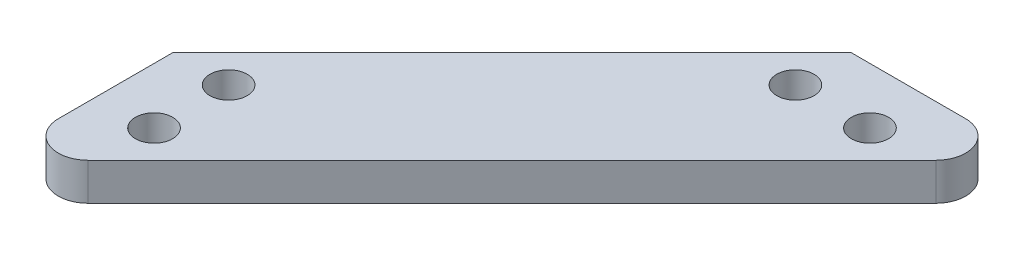
ISO-10303-21;
HEADER;
FILE_DESCRIPTION(('STEP AP214'),'2;1');
FILE_NAME('part.step','',(''),(''),'','','');
FILE_SCHEMA(('AUTOMOTIVE_DESIGN { 1 0 10303 214 1 1 1 1 }'));
ENDSEC;
DATA;
#1=APPLICATION_CONTEXT('core data for automotive mechanical design processes');
#2=APPLICATION_PROTOCOL_DEFINITION('international standard','automotive_design',2000,#1);
#3=PRODUCT_CONTEXT('',#1,'mechanical');
#4=PRODUCT('Part','Part','',(#3));
#5=PRODUCT_RELATED_PRODUCT_CATEGORY('part','',(#4));
#6=PRODUCT_DEFINITION_FORMATION('','',#4);
#7=PRODUCT_DEFINITION_CONTEXT('part definition',#1,'design');
#8=PRODUCT_DEFINITION('design','',#6,#7);
#9=PRODUCT_DEFINITION_SHAPE('','',#8);
#10=(LENGTH_UNIT() NAMED_UNIT(*) SI_UNIT(.MILLI.,.METRE.));
#11=(NAMED_UNIT(*) PLANE_ANGLE_UNIT() SI_UNIT($,.RADIAN.));
#12=(NAMED_UNIT(*) SI_UNIT($,.STERADIAN.) SOLID_ANGLE_UNIT());
#13=UNCERTAINTY_MEASURE_WITH_UNIT(LENGTH_MEASURE(1.E-05),#10,'distance_accuracy_value','');
#14=(GEOMETRIC_REPRESENTATION_CONTEXT(3) GLOBAL_UNCERTAINTY_ASSIGNED_CONTEXT((#13)) GLOBAL_UNIT_ASSIGNED_CONTEXT((#10,
#11,#12)) REPRESENTATION_CONTEXT('',''));
#15=CARTESIAN_POINT('',(0.,0.,0.));
#16=DIRECTION('',(0.,0.,1.));
#17=DIRECTION('',(1.,0.,0.));
#18=AXIS2_PLACEMENT_3D('',#15,#16,#17);
#19=CARTESIAN_POINT('',(-11.9125943882363,3.175,24.1954919398086));
#20=DIRECTION('',(0.,1.,0.));
#21=DIRECTION('',(0.,0.,1.));
#22=AXIS2_PLACEMENT_3D('',#19,#20,#21);
#23=PLANE('',#22);
#24=CARTESIAN_POINT('',(20.8025943882363,3.175,-9.69009438823627));
#25=DIRECTION('',(0.,1.,0.));
#26=DIRECTION('',(0.,0.,-1.));
#27=AXIS2_PLACEMENT_3D('',#24,#25,#26);
#28=CIRCLE('',#27,1.5875);
#29=CARTESIAN_POINT('',(20.8025943882363,3.175,-11.2775943882363));
#30=VERTEX_POINT('',#29);
#31=EDGE_CURVE('E212',#30,#30,#28,.T.);
#32=ORIENTED_EDGE('',*,*,#31,.F.);
#33=EDGE_LOOP('',(#32));
#34=FACE_BOUND('',#33,.T.);
#35=CARTESIAN_POINT('',(-9.69009438823626,3.175,14.4525943882363));
#36=DIRECTION('',(0.,1.,0.));
#37=DIRECTION('',(0.,0.,1.));
#38=AXIS2_PLACEMENT_3D('',#35,#36,#37);
#39=CIRCLE('',#38,1.5875);
#40=CARTESIAN_POINT('',(-9.69009438823626,3.175,16.0400943882363));
#41=VERTEX_POINT('',#40);
#42=EDGE_CURVE('E134',#41,#41,#39,.T.);
#43=ORIENTED_EDGE('',*,*,#42,.F.);
#44=EDGE_LOOP('',(#43));
#45=FACE_BOUND('',#44,.T.);
#46=DIRECTION('',(0.,0.,1.));
#47=VECTOR('',#46,1.);
#48=CARTESIAN_POINT('',(-14.4525943882363,3.175,14.4525943882363));
#49=LINE('',#48,#47);
#50=CARTESIAN_POINT('',(-14.4525943882363,3.175,14.4525943882363));
#51=VERTEX_POINT('',#50);
#52=CARTESIAN_POINT('',(-14.4525943882363,3.175,24.1954919398086));
#53=VERTEX_POINT('',#52);
#54=EDGE_CURVE('E146',#51,#53,#49,.T.);
#55=ORIENTED_EDGE('',*,*,#54,.T.);
#56=CARTESIAN_POINT('',(-11.9125943882363,3.175,24.1954919398086));
#57=DIRECTION('',(0.,1.,0.));
#58=DIRECTION('',(0.,0.,1.));
#59=AXIS2_PLACEMENT_3D('',#56,#57,#58);
#60=CIRCLE('',#59,2.54);
#61=CARTESIAN_POINT('',(-10.1165431640224,3.175,25.9915431640224));
#62=VERTEX_POINT('',#61);
#63=EDGE_CURVE('E94',#53,#62,#60,.T.);
#64=ORIENTED_EDGE('',*,*,#63,.T.);
#65=DIRECTION('',(0.707106781186547,0.,-0.707106781186548));
#66=VECTOR('',#65,1.);
#67=CARTESIAN_POINT('',(-10.1165431640224,3.175,25.9915431640224));
#68=LINE('',#67,#66);
#69=CARTESIAN_POINT('',(25.9915431640224,3.175,-10.1165431640224));
#70=VERTEX_POINT('',#69);
#71=EDGE_CURVE('E107',#62,#70,#68,.T.);
#72=ORIENTED_EDGE('',*,*,#71,.T.);
#73=CARTESIAN_POINT('',(24.1954919398086,3.175,-11.9125943882363));
#74=DIRECTION('',(0.,1.,0.));
#75=DIRECTION('',(0.,0.,-1.));
#76=AXIS2_PLACEMENT_3D('',#73,#74,#75);
#77=CIRCLE('',#76,2.54);
#78=CARTESIAN_POINT('',(24.1954919398085,3.175,-14.4525943882363));
#79=VERTEX_POINT('',#78);
#80=EDGE_CURVE('E101',#70,#79,#77,.T.);
#81=ORIENTED_EDGE('',*,*,#80,.T.);
#82=DIRECTION('',(-1.,0.,0.));
#83=VECTOR('',#82,1.);
#84=CARTESIAN_POINT('',(14.4525943882363,3.175,-14.4525943882363));
#85=LINE('',#84,#83);
#86=CARTESIAN_POINT('',(14.4525943882363,3.175,-14.4525943882363));
#87=VERTEX_POINT('',#86);
#88=EDGE_CURVE('E105',#79,#87,#85,.T.);
#89=ORIENTED_EDGE('',*,*,#88,.T.);
#90=DIRECTION('',(-0.707106781186547,0.,0.707106781186548));
#91=VECTOR('',#90,1.);
#92=CARTESIAN_POINT('',(-14.4525943882363,3.175,14.4525943882363));
#93=LINE('',#92,#91);
#94=EDGE_CURVE('E57',#87,#51,#93,.T.);
#95=ORIENTED_EDGE('',*,*,#94,.T.);
#96=EDGE_LOOP('',(#55,#64,#72,#81,#89,#95));
#97=FACE_BOUND('',#96,.T.);
#98=CARTESIAN_POINT('',(-9.69009438823626,3.175,20.8025943882363));
#99=DIRECTION('',(0.,1.,0.));
#100=DIRECTION('',(0.,0.,1.));
#101=AXIS2_PLACEMENT_3D('',#98,#99,#100);
#102=CIRCLE('',#101,1.5875);
#103=CARTESIAN_POINT('',(-9.69009438823626,3.175,22.3900943882363));
#104=VERTEX_POINT('',#103);
#105=EDGE_CURVE('E220',#104,#104,#102,.T.);
#106=ORIENTED_EDGE('',*,*,#105,.F.);
#107=EDGE_LOOP('',(#106));
#108=FACE_BOUND('',#107,.T.);
#109=CARTESIAN_POINT('',(14.4525943882363,3.175,-9.69009438823626));
#110=DIRECTION('',(0.,1.,0.));
#111=DIRECTION('',(0.,0.,-1.));
#112=AXIS2_PLACEMENT_3D('',#109,#110,#111);
#113=CIRCLE('',#112,1.5875);
#114=CARTESIAN_POINT('',(14.4525943882363,3.175,-11.2775943882363));
#115=VERTEX_POINT('',#114);
#116=EDGE_CURVE('E201',#115,#115,#113,.T.);
#117=ORIENTED_EDGE('',*,*,#116,.F.);
#118=EDGE_LOOP('',(#117));
#119=FACE_BOUND('',#118,.T.);
#120=ADVANCED_FACE('F39',(#34,#45,#97,#108,#119),#23,.T.);
#121=CARTESIAN_POINT('',(-11.9125943882363,0.,24.1954919398086));
#122=DIRECTION('',(0.,1.,0.));
#123=DIRECTION('',(0.,0.,1.));
#124=AXIS2_PLACEMENT_3D('',#121,#122,#123);
#125=PLANE('',#124);
#126=DIRECTION('',(0.,0.,1.));
#127=VECTOR('',#126,1.);
#128=CARTESIAN_POINT('',(-14.4525943882363,0.,14.4525943882363));
#129=LINE('',#128,#127);
#130=CARTESIAN_POINT('',(-14.4525943882363,0.,14.4525943882363));
#131=VERTEX_POINT('',#130);
#132=CARTESIAN_POINT('',(-14.4525943882363,0.,24.1954919398086));
#133=VERTEX_POINT('',#132);
#134=EDGE_CURVE('E129',#131,#133,#129,.T.);
#135=ORIENTED_EDGE('',*,*,#134,.F.);
#136=DIRECTION('',(-0.707106781186547,0.,0.707106781186548));
#137=VECTOR('',#136,1.);
#138=CARTESIAN_POINT('',(-14.4525943882363,0.,14.4525943882363));
#139=LINE('',#138,#137);
#140=CARTESIAN_POINT('',(14.4525943882363,0.,-14.4525943882363));
#141=VERTEX_POINT('',#140);
#142=EDGE_CURVE('E86',#141,#131,#139,.T.);
#143=ORIENTED_EDGE('',*,*,#142,.F.);
#144=DIRECTION('',(-1.,0.,0.));
#145=VECTOR('',#144,1.);
#146=CARTESIAN_POINT('',(14.4525943882363,0.,-14.4525943882363));
#147=LINE('',#146,#145);
#148=CARTESIAN_POINT('',(24.1954919398085,0.,-14.4525943882363));
#149=VERTEX_POINT('',#148);
#150=EDGE_CURVE('E80',#149,#141,#147,.T.);
#151=ORIENTED_EDGE('',*,*,#150,.F.);
#152=CARTESIAN_POINT('',(24.1954919398086,0.,-11.9125943882363));
#153=DIRECTION('',(0.,1.,0.));
#154=DIRECTION('',(0.,0.,-1.));
#155=AXIS2_PLACEMENT_3D('',#152,#153,#154);
#156=CIRCLE('',#155,2.54);
#157=CARTESIAN_POINT('',(25.9915431640224,0.,-10.1165431640224));
#158=VERTEX_POINT('',#157);
#159=EDGE_CURVE('E116',#158,#149,#156,.T.);
#160=ORIENTED_EDGE('',*,*,#159,.F.);
#161=DIRECTION('',(0.707106781186547,0.,-0.707106781186548));
#162=VECTOR('',#161,1.);
#163=CARTESIAN_POINT('',(-10.1165431640224,0.,25.9915431640224));
#164=LINE('',#163,#162);
#165=CARTESIAN_POINT('',(-10.1165431640224,0.,25.9915431640224));
#166=VERTEX_POINT('',#165);
#167=EDGE_CURVE('E137',#166,#158,#164,.T.);
#168=ORIENTED_EDGE('',*,*,#167,.F.);
#169=CARTESIAN_POINT('',(-11.9125943882363,0.,24.1954919398086));
#170=DIRECTION('',(0.,1.,0.));
#171=DIRECTION('',(0.,0.,1.));
#172=AXIS2_PLACEMENT_3D('',#169,#170,#171);
#173=CIRCLE('',#172,2.54);
#174=EDGE_CURVE('E133',#133,#166,#173,.T.);
#175=ORIENTED_EDGE('',*,*,#174,.F.);
#176=EDGE_LOOP('',(#135,#143,#151,#160,#168,#175));
#177=FACE_BOUND('',#176,.T.);
#178=CARTESIAN_POINT('',(-9.69009438823626,0.,14.4525943882363));
#179=DIRECTION('',(0.,1.,0.));
#180=DIRECTION('',(0.,0.,1.));
#181=AXIS2_PLACEMENT_3D('',#178,#179,#180);
#182=CIRCLE('',#181,1.5875);
#183=CARTESIAN_POINT('',(-9.69009438823626,0.,16.0400943882363));
#184=VERTEX_POINT('',#183);
#185=EDGE_CURVE('E224',#184,#184,#182,.T.);
#186=ORIENTED_EDGE('',*,*,#185,.T.);
#187=EDGE_LOOP('',(#186));
#188=FACE_BOUND('',#187,.T.);
#189=CARTESIAN_POINT('',(-9.69009438823626,0.,20.8025943882363));
#190=DIRECTION('',(0.,1.,0.));
#191=DIRECTION('',(0.,0.,1.));
#192=AXIS2_PLACEMENT_3D('',#189,#190,#191);
#193=CIRCLE('',#192,1.5875);
#194=CARTESIAN_POINT('',(-9.69009438823626,0.,22.3900943882363));
#195=VERTEX_POINT('',#194);
#196=EDGE_CURVE('E216',#195,#195,#193,.T.);
#197=ORIENTED_EDGE('',*,*,#196,.T.);
#198=EDGE_LOOP('',(#197));
#199=FACE_BOUND('',#198,.T.);
#200=CARTESIAN_POINT('',(20.8025943882363,0.,-9.69009438823627));
#201=DIRECTION('',(0.,1.,0.));
#202=DIRECTION('',(0.,0.,-1.));
#203=AXIS2_PLACEMENT_3D('',#200,#201,#202);
#204=CIRCLE('',#203,1.5875);
#205=CARTESIAN_POINT('',(20.8025943882363,0.,-11.2775943882363));
#206=VERTEX_POINT('',#205);
#207=EDGE_CURVE('E209',#206,#206,#204,.T.);
#208=ORIENTED_EDGE('',*,*,#207,.T.);
#209=EDGE_LOOP('',(#208));
#210=FACE_BOUND('',#209,.T.);
#211=CARTESIAN_POINT('',(14.4525943882363,0.,-9.69009438823626));
#212=DIRECTION('',(0.,1.,0.));
#213=DIRECTION('',(0.,0.,-1.));
#214=AXIS2_PLACEMENT_3D('',#211,#212,#213);
#215=CIRCLE('',#214,1.5875);
#216=CARTESIAN_POINT('',(14.4525943882363,0.,-11.2775943882363));
#217=VERTEX_POINT('',#216);
#218=EDGE_CURVE('E204',#217,#217,#215,.T.);
#219=ORIENTED_EDGE('',*,*,#218,.T.);
#220=EDGE_LOOP('',(#219));
#221=FACE_BOUND('',#220,.T.);
#222=ADVANCED_FACE('F159',(#177,#188,#199,#210,#221),#125,.F.);
#223=CARTESIAN_POINT('',(-14.4525943882363,3.175,14.4525943882363));
#224=DIRECTION('',(1.,0.,0.));
#225=DIRECTION('',(0.,0.,-1.));
#226=AXIS2_PLACEMENT_3D('',#223,#224,#225);
#227=PLANE('',#226);
#228=ORIENTED_EDGE('',*,*,#134,.T.);
#229=DIRECTION('',(0.,-1.,0.));
#230=VECTOR('',#229,1.);
#231=CARTESIAN_POINT('',(-14.4525943882363,3.175,24.1954919398086));
#232=LINE('',#231,#230);
#233=EDGE_CURVE('E11',#53,#133,#232,.T.);
#234=ORIENTED_EDGE('',*,*,#233,.F.);
#235=ORIENTED_EDGE('',*,*,#54,.F.);
#236=DIRECTION('',(0.,-1.,0.));
#237=VECTOR('',#236,1.);
#238=CARTESIAN_POINT('',(-14.4525943882363,3.175,14.4525943882363));
#239=LINE('',#238,#237);
#240=EDGE_CURVE('E125',#51,#131,#239,.T.);
#241=ORIENTED_EDGE('',*,*,#240,.T.);
#242=EDGE_LOOP('',(#228,#234,#235,#241));
#243=FACE_BOUND('',#242,.T.);
#244=ADVANCED_FACE('F41',(#243),#227,.F.);
#245=CARTESIAN_POINT('',(-11.9125943882363,3.175,24.1954919398086));
#246=DIRECTION('',(0.,-1.,0.));
#247=DIRECTION('',(0.,0.,-1.));
#248=AXIS2_PLACEMENT_3D('',#245,#246,#247);
#249=CYLINDRICAL_SURFACE('',#248,2.54);
#250=ORIENTED_EDGE('',*,*,#174,.T.);
#251=DIRECTION('',(0.,-1.,0.));
#252=VECTOR('',#251,1.);
#253=CARTESIAN_POINT('',(-10.1165431640224,3.175,25.9915431640224));
#254=LINE('',#253,#252);
#255=EDGE_CURVE('E49',#62,#166,#254,.T.);
#256=ORIENTED_EDGE('',*,*,#255,.F.);
#257=ORIENTED_EDGE('',*,*,#63,.F.);
#258=ORIENTED_EDGE('',*,*,#233,.T.);
#259=EDGE_LOOP('',(#250,#256,#257,#258));
#260=FACE_BOUND('',#259,.T.);
#261=ADVANCED_FACE('F288',(#260),#249,.T.);
#262=CARTESIAN_POINT('',(-10.1165431640224,3.175,25.9915431640224));
#263=DIRECTION('',(-0.707106781186548,0.,-0.707106781186547));
#264=DIRECTION('',(-0.707106781186547,0.,0.707106781186548));
#265=AXIS2_PLACEMENT_3D('',#262,#263,#264);
#266=PLANE('',#265);
#267=ORIENTED_EDGE('',*,*,#167,.T.);
#268=DIRECTION('',(0.,-1.,0.));
#269=VECTOR('',#268,1.);
#270=CARTESIAN_POINT('',(25.9915431640224,3.175,-10.1165431640224));
#271=LINE('',#270,#269);
#272=EDGE_CURVE('E118',#70,#158,#271,.T.);
#273=ORIENTED_EDGE('',*,*,#272,.F.);
#274=ORIENTED_EDGE('',*,*,#71,.F.);
#275=ORIENTED_EDGE('',*,*,#255,.T.);
#276=EDGE_LOOP('',(#267,#273,#274,#275));
#277=FACE_BOUND('',#276,.T.);
#278=ADVANCED_FACE('F156',(#277),#266,.F.);
#279=CARTESIAN_POINT('',(24.1954919398086,3.175,-11.9125943882363));
#280=DIRECTION('',(0.,-1.,0.));
#281=DIRECTION('',(0.,0.,-1.));
#282=AXIS2_PLACEMENT_3D('',#279,#280,#281);
#283=CYLINDRICAL_SURFACE('',#282,2.54);
#284=ORIENTED_EDGE('',*,*,#159,.T.);
#285=DIRECTION('',(0.,-1.,0.));
#286=VECTOR('',#285,1.);
#287=CARTESIAN_POINT('',(24.1954919398085,3.175,-14.4525943882363));
#288=LINE('',#287,#286);
#289=EDGE_CURVE('E113',#79,#149,#288,.T.);
#290=ORIENTED_EDGE('',*,*,#289,.F.);
#291=ORIENTED_EDGE('',*,*,#80,.F.);
#292=ORIENTED_EDGE('',*,*,#272,.T.);
#293=EDGE_LOOP('',(#284,#290,#291,#292));
#294=FACE_BOUND('',#293,.T.);
#295=ADVANCED_FACE('F114',(#294),#283,.T.);
#296=CARTESIAN_POINT('',(14.4525943882363,3.175,-14.4525943882363));
#297=DIRECTION('',(0.,0.,1.));
#298=DIRECTION('',(1.,0.,0.));
#299=AXIS2_PLACEMENT_3D('',#296,#297,#298);
#300=PLANE('',#299);
#301=ORIENTED_EDGE('',*,*,#150,.T.);
#302=DIRECTION('',(0.,-1.,0.));
#303=VECTOR('',#302,1.);
#304=CARTESIAN_POINT('',(14.4525943882363,3.175,-14.4525943882363));
#305=LINE('',#304,#303);
#306=EDGE_CURVE('E119',#87,#141,#305,.T.);
#307=ORIENTED_EDGE('',*,*,#306,.F.);
#308=ORIENTED_EDGE('',*,*,#88,.F.);
#309=ORIENTED_EDGE('',*,*,#289,.T.);
#310=EDGE_LOOP('',(#301,#307,#308,#309));
#311=FACE_BOUND('',#310,.T.);
#312=ADVANCED_FACE('F121',(#311),#300,.F.);
#313=CARTESIAN_POINT('',(-14.4525943882363,3.175,14.4525943882363));
#314=DIRECTION('',(0.707106781186548,0.,0.707106781186547));
#315=DIRECTION('',(0.707106781186547,0.,-0.707106781186548));
#316=AXIS2_PLACEMENT_3D('',#313,#314,#315);
#317=PLANE('',#316);
#318=ORIENTED_EDGE('',*,*,#142,.T.);
#319=ORIENTED_EDGE('',*,*,#240,.F.);
#320=ORIENTED_EDGE('',*,*,#94,.F.);
#321=ORIENTED_EDGE('',*,*,#306,.T.);
#322=EDGE_LOOP('',(#318,#319,#320,#321));
#323=FACE_BOUND('',#322,.T.);
#324=ADVANCED_FACE('F164',(#323),#317,.F.);
#325=CARTESIAN_POINT('',(-9.69009438823626,3.175,14.4525943882363));
#326=DIRECTION('',(0.,-1.,0.));
#327=DIRECTION('',(0.,0.,-1.));
#328=AXIS2_PLACEMENT_3D('',#325,#326,#327);
#329=CYLINDRICAL_SURFACE('',#328,1.5875);
#330=ORIENTED_EDGE('',*,*,#42,.T.);
#331=EDGE_LOOP('',(#330));
#332=FACE_BOUND('',#331,.T.);
#333=ORIENTED_EDGE('',*,*,#185,.F.);
#334=EDGE_LOOP('',(#333));
#335=FACE_BOUND('',#334,.T.);
#336=ADVANCED_FACE('F166',(#332,#335),#329,.F.);
#337=CARTESIAN_POINT('',(-9.69009438823626,3.175,20.8025943882363));
#338=DIRECTION('',(0.,-1.,0.));
#339=DIRECTION('',(0.,0.,-1.));
#340=AXIS2_PLACEMENT_3D('',#337,#338,#339);
#341=CYLINDRICAL_SURFACE('',#340,1.5875);
#342=ORIENTED_EDGE('',*,*,#105,.T.);
#343=EDGE_LOOP('',(#342));
#344=FACE_BOUND('',#343,.T.);
#345=ORIENTED_EDGE('',*,*,#196,.F.);
#346=EDGE_LOOP('',(#345));
#347=FACE_BOUND('',#346,.T.);
#348=ADVANCED_FACE('F172',(#344,#347),#341,.F.);
#349=CARTESIAN_POINT('',(20.8025943882363,3.175,-9.69009438823627));
#350=DIRECTION('',(0.,-1.,0.));
#351=DIRECTION('',(0.,0.,-1.));
#352=AXIS2_PLACEMENT_3D('',#349,#350,#351);
#353=CYLINDRICAL_SURFACE('',#352,1.5875);
#354=ORIENTED_EDGE('',*,*,#31,.T.);
#355=EDGE_LOOP('',(#354));
#356=FACE_BOUND('',#355,.T.);
#357=ORIENTED_EDGE('',*,*,#207,.F.);
#358=EDGE_LOOP('',(#357));
#359=FACE_BOUND('',#358,.T.);
#360=ADVANCED_FACE('F188',(#356,#359),#353,.F.);
#361=CARTESIAN_POINT('',(14.4525943882363,3.175,-9.69009438823626));
#362=DIRECTION('',(0.,-1.,0.));
#363=DIRECTION('',(0.,0.,-1.));
#364=AXIS2_PLACEMENT_3D('',#361,#362,#363);
#365=CYLINDRICAL_SURFACE('',#364,1.5875);
#366=ORIENTED_EDGE('',*,*,#116,.T.);
#367=EDGE_LOOP('',(#366));
#368=FACE_BOUND('',#367,.T.);
#369=ORIENTED_EDGE('',*,*,#218,.F.);
#370=EDGE_LOOP('',(#369));
#371=FACE_BOUND('',#370,.T.);
#372=ADVANCED_FACE('F192',(#368,#371),#365,.F.);
#373=CLOSED_SHELL('',(#120,#222,#244,#261,#278,#295,#312,#324,#336,#348,#360,#372));
#374=MANIFOLD_SOLID_BREP('B2',#373);
#375=ADVANCED_BREP_SHAPE_REPRESENTATION('',(#18,#374),#14);
#376=SHAPE_DEFINITION_REPRESENTATION(#9,#375);
ENDSEC;
END-ISO-10303-21;
